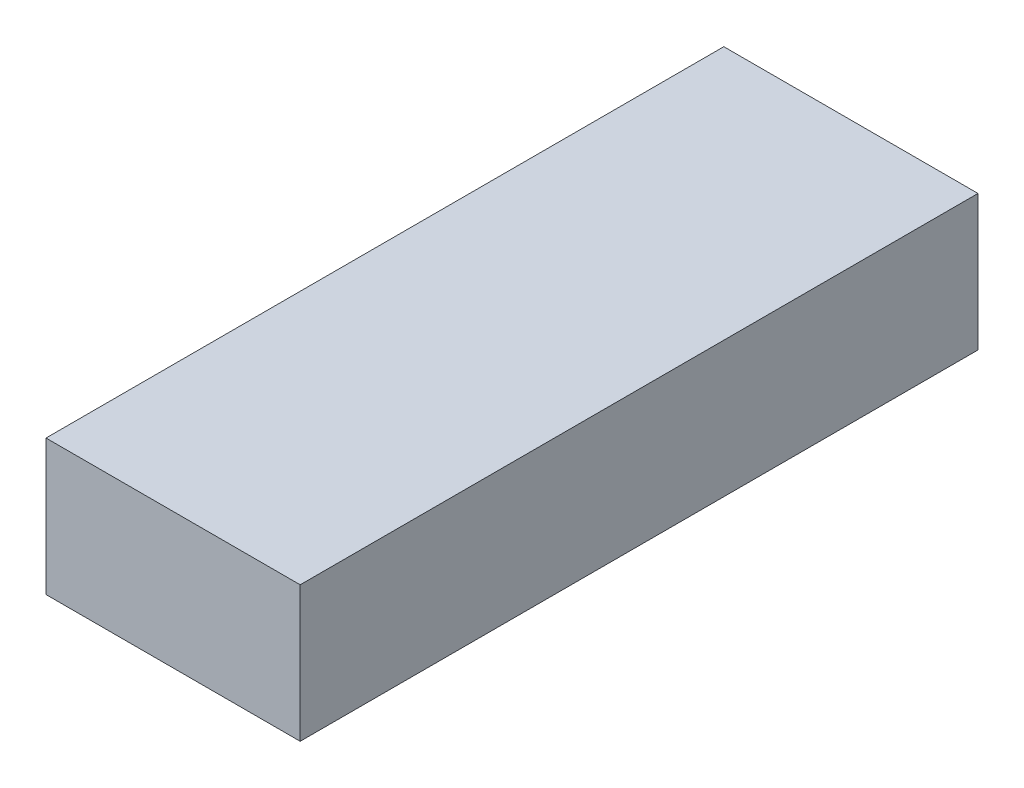
ISO-10303-21;
HEADER;
FILE_DESCRIPTION(('STEP AP214'),'2;1');
FILE_NAME('part.step','',(''),(''),'','','');
FILE_SCHEMA(('AUTOMOTIVE_DESIGN { 1 0 10303 214 1 1 1 1 }'));
ENDSEC;
DATA;
#1=APPLICATION_CONTEXT('core data for automotive mechanical design processes');
#2=APPLICATION_PROTOCOL_DEFINITION('international standard','automotive_design',2000,#1);
#3=PRODUCT_CONTEXT('',#1,'mechanical');
#4=PRODUCT('Part','Part','',(#3));
#5=PRODUCT_RELATED_PRODUCT_CATEGORY('part','',(#4));
#6=PRODUCT_DEFINITION_FORMATION('','',#4);
#7=PRODUCT_DEFINITION_CONTEXT('part definition',#1,'design');
#8=PRODUCT_DEFINITION('design','',#6,#7);
#9=PRODUCT_DEFINITION_SHAPE('','',#8);
#10=(LENGTH_UNIT() NAMED_UNIT(*) SI_UNIT(.MILLI.,.METRE.));
#11=(NAMED_UNIT(*) PLANE_ANGLE_UNIT() SI_UNIT($,.RADIAN.));
#12=(NAMED_UNIT(*) SI_UNIT($,.STERADIAN.) SOLID_ANGLE_UNIT());
#13=UNCERTAINTY_MEASURE_WITH_UNIT(LENGTH_MEASURE(1.E-05),#10,'distance_accuracy_value','');
#14=(GEOMETRIC_REPRESENTATION_CONTEXT(3) GLOBAL_UNCERTAINTY_ASSIGNED_CONTEXT((#13)) GLOBAL_UNIT_ASSIGNED_CONTEXT((#10,
#11,#12)) REPRESENTATION_CONTEXT('',''));
#15=CARTESIAN_POINT('',(0.,0.,0.));
#16=DIRECTION('',(0.,0.,1.));
#17=DIRECTION('',(1.,0.,0.));
#18=AXIS2_PLACEMENT_3D('',#15,#16,#17);
#19=CARTESIAN_POINT('',(70.,-35.,400.));
#20=DIRECTION('',(-1.,0.,0.));
#21=DIRECTION('',(0.,0.,1.));
#22=AXIS2_PLACEMENT_3D('',#19,#20,#21);
#23=PLANE('',#22);
#24=DIRECTION('',(0.,0.,-1.));
#25=VECTOR('',#24,1.);
#26=CARTESIAN_POINT('',(70.,-35.,400.));
#27=LINE('',#26,#25);
#28=CARTESIAN_POINT('',(70.,-35.,395.));
#29=VERTEX_POINT('',#28);
#30=CARTESIAN_POINT('',(70.,-35.,0.));
#31=VERTEX_POINT('',#30);
#32=EDGE_CURVE('E65',#29,#31,#27,.T.);
#33=ORIENTED_EDGE('',*,*,#32,.F.);
#34=DIRECTION('',(0.,1.,0.));
#35=VECTOR('',#34,1.);
#36=CARTESIAN_POINT('',(70.,-35.,395.));
#37=LINE('',#36,#35);
#38=CARTESIAN_POINT('',(70.,35.,395.));
#39=VERTEX_POINT('',#38);
#40=EDGE_CURVE('E59',#29,#39,#37,.T.);
#41=ORIENTED_EDGE('',*,*,#40,.T.);
#42=DIRECTION('',(0.,0.,-1.));
#43=VECTOR('',#42,1.);
#44=CARTESIAN_POINT('',(70.,35.,400.));
#45=LINE('',#44,#43);
#46=CARTESIAN_POINT('',(70.,35.,0.));
#47=VERTEX_POINT('',#46);
#48=EDGE_CURVE('E128',#39,#47,#45,.T.);
#49=ORIENTED_EDGE('',*,*,#48,.T.);
#50=DIRECTION('',(0.,1.,0.));
#51=VECTOR('',#50,1.);
#52=CARTESIAN_POINT('',(70.,-35.,0.));
#53=LINE('',#52,#51);
#54=EDGE_CURVE('E312',#31,#47,#53,.T.);
#55=ORIENTED_EDGE('',*,*,#54,.F.);
#56=EDGE_LOOP('',(#33,#41,#49,#55));
#57=FACE_BOUND('',#56,.T.);
#58=ADVANCED_FACE('F43',(#57),#23,.T.);
#59=CARTESIAN_POINT('',(-70.,35.,400.));
#60=DIRECTION('',(0.,-1.,0.));
#61=DIRECTION('',(0.,0.,-1.));
#62=AXIS2_PLACEMENT_3D('',#59,#60,#61);
#63=PLANE('',#62);
#64=ORIENTED_EDGE('',*,*,#48,.F.);
#65=DIRECTION('',(-1.,0.,0.));
#66=VECTOR('',#65,1.);
#67=CARTESIAN_POINT('',(-70.,35.,395.));
#68=LINE('',#67,#66);
#69=CARTESIAN_POINT('',(-70.,35.,395.));
#70=VERTEX_POINT('',#69);
#71=EDGE_CURVE('E118',#39,#70,#68,.T.);
#72=ORIENTED_EDGE('',*,*,#71,.T.);
#73=DIRECTION('',(0.,0.,-1.));
#74=VECTOR('',#73,1.);
#75=CARTESIAN_POINT('',(-70.,35.,400.));
#76=LINE('',#75,#74);
#77=CARTESIAN_POINT('',(-70.,35.,0.));
#78=VERTEX_POINT('',#77);
#79=EDGE_CURVE('E116',#70,#78,#76,.T.);
#80=ORIENTED_EDGE('',*,*,#79,.T.);
#81=DIRECTION('',(-1.,0.,0.));
#82=VECTOR('',#81,1.);
#83=CARTESIAN_POINT('',(-70.,35.,0.));
#84=LINE('',#83,#82);
#85=EDGE_CURVE('E316',#47,#78,#84,.T.);
#86=ORIENTED_EDGE('',*,*,#85,.F.);
#87=EDGE_LOOP('',(#64,#72,#80,#86));
#88=FACE_BOUND('',#87,.T.);
#89=ADVANCED_FACE('F208',(#88),#63,.T.);
#90=CARTESIAN_POINT('',(-70.,-35.,400.));
#91=DIRECTION('',(1.,0.,0.));
#92=DIRECTION('',(0.,0.,-1.));
#93=AXIS2_PLACEMENT_3D('',#90,#91,#92);
#94=PLANE('',#93);
#95=ORIENTED_EDGE('',*,*,#79,.F.);
#96=DIRECTION('',(0.,-1.,0.));
#97=VECTOR('',#96,1.);
#98=CARTESIAN_POINT('',(-70.,-35.,395.));
#99=LINE('',#98,#97);
#100=CARTESIAN_POINT('',(-70.,-35.,395.));
#101=VERTEX_POINT('',#100);
#102=EDGE_CURVE('E108',#70,#101,#99,.T.);
#103=ORIENTED_EDGE('',*,*,#102,.T.);
#104=DIRECTION('',(0.,0.,-1.));
#105=VECTOR('',#104,1.);
#106=CARTESIAN_POINT('',(-70.,-35.,400.));
#107=LINE('',#106,#105);
#108=CARTESIAN_POINT('',(-70.,-35.,0.));
#109=VERTEX_POINT('',#108);
#110=EDGE_CURVE('E115',#101,#109,#107,.T.);
#111=ORIENTED_EDGE('',*,*,#110,.T.);
#112=DIRECTION('',(0.,-1.,0.));
#113=VECTOR('',#112,1.);
#114=CARTESIAN_POINT('',(-70.,-35.,0.));
#115=LINE('',#114,#113);
#116=EDGE_CURVE('E318',#78,#109,#115,.T.);
#117=ORIENTED_EDGE('',*,*,#116,.F.);
#118=EDGE_LOOP('',(#95,#103,#111,#117));
#119=FACE_BOUND('',#118,.T.);
#120=ADVANCED_FACE('F113',(#119),#94,.T.);
#121=CARTESIAN_POINT('',(-70.,-35.,400.));
#122=DIRECTION('',(0.,1.,0.));
#123=DIRECTION('',(0.,0.,1.));
#124=AXIS2_PLACEMENT_3D('',#121,#122,#123);
#125=PLANE('',#124);
#126=ORIENTED_EDGE('',*,*,#110,.F.);
#127=DIRECTION('',(1.,0.,0.));
#128=VECTOR('',#127,1.);
#129=CARTESIAN_POINT('',(-70.,-35.,395.));
#130=LINE('',#129,#128);
#131=EDGE_CURVE('E11',#101,#29,#130,.T.);
#132=ORIENTED_EDGE('',*,*,#131,.T.);
#133=ORIENTED_EDGE('',*,*,#32,.T.);
#134=DIRECTION('',(1.,0.,0.));
#135=VECTOR('',#134,1.);
#136=CARTESIAN_POINT('',(-70.,-35.,0.));
#137=LINE('',#136,#135);
#138=EDGE_CURVE('E122',#109,#31,#137,.T.);
#139=ORIENTED_EDGE('',*,*,#138,.F.);
#140=EDGE_LOOP('',(#126,#132,#133,#139));
#141=FACE_BOUND('',#140,.T.);
#142=ADVANCED_FACE('F120',(#141),#125,.T.);
#143=CARTESIAN_POINT('',(0.,0.,400.));
#144=DIRECTION('',(0.,0.,-1.));
#145=DIRECTION('',(-1.,0.,0.));
#146=AXIS2_PLACEMENT_3D('',#143,#144,#145);
#147=PLANE('',#146);
#148=DIRECTION('',(0.,1.,0.));
#149=VECTOR('',#148,1.);
#150=CARTESIAN_POINT('',(75.,-40.,400.));
#151=LINE('',#150,#149);
#152=CARTESIAN_POINT('',(75.,-40.,400.));
#153=VERTEX_POINT('',#152);
#154=CARTESIAN_POINT('',(75.,40.,400.));
#155=VERTEX_POINT('',#154);
#156=EDGE_CURVE('E136',#153,#155,#151,.T.);
#157=ORIENTED_EDGE('',*,*,#156,.T.);
#158=DIRECTION('',(-1.,0.,0.));
#159=VECTOR('',#158,1.);
#160=CARTESIAN_POINT('',(-75.,40.,400.));
#161=LINE('',#160,#159);
#162=CARTESIAN_POINT('',(-75.,40.,400.));
#163=VERTEX_POINT('',#162);
#164=EDGE_CURVE('E140',#155,#163,#161,.T.);
#165=ORIENTED_EDGE('',*,*,#164,.T.);
#166=DIRECTION('',(0.,-1.,0.));
#167=VECTOR('',#166,1.);
#168=CARTESIAN_POINT('',(-75.,-40.,400.));
#169=LINE('',#168,#167);
#170=CARTESIAN_POINT('',(-75.,-40.,400.));
#171=VERTEX_POINT('',#170);
#172=EDGE_CURVE('E144',#163,#171,#169,.T.);
#173=ORIENTED_EDGE('',*,*,#172,.T.);
#174=DIRECTION('',(1.,0.,0.));
#175=VECTOR('',#174,1.);
#176=CARTESIAN_POINT('',(-75.,-40.,400.));
#177=LINE('',#176,#175);
#178=EDGE_CURVE('E147',#171,#153,#177,.T.);
#179=ORIENTED_EDGE('',*,*,#178,.T.);
#180=EDGE_LOOP('',(#157,#165,#173,#179));
#181=FACE_BOUND('',#180,.T.);
#182=ADVANCED_FACE('F195',(#181),#147,.F.);
#183=CARTESIAN_POINT('',(0.,0.,0.));
#184=DIRECTION('',(0.,0.,-1.));
#185=DIRECTION('',(-1.,0.,0.));
#186=AXIS2_PLACEMENT_3D('',#183,#184,#185);
#187=PLANE('',#186);
#188=DIRECTION('',(0.,1.,0.));
#189=VECTOR('',#188,1.);
#190=CARTESIAN_POINT('',(75.,-40.,0.));
#191=LINE('',#190,#189);
#192=CARTESIAN_POINT('',(75.,-40.,0.));
#193=VERTEX_POINT('',#192);
#194=CARTESIAN_POINT('',(75.,40.,0.));
#195=VERTEX_POINT('',#194);
#196=EDGE_CURVE('E135',#193,#195,#191,.T.);
#197=ORIENTED_EDGE('',*,*,#196,.F.);
#198=DIRECTION('',(1.,0.,0.));
#199=VECTOR('',#198,1.);
#200=CARTESIAN_POINT('',(-75.,-40.,0.));
#201=LINE('',#200,#199);
#202=CARTESIAN_POINT('',(-75.,-40.,0.));
#203=VERTEX_POINT('',#202);
#204=EDGE_CURVE('E141',#203,#193,#201,.T.);
#205=ORIENTED_EDGE('',*,*,#204,.F.);
#206=DIRECTION('',(0.,-1.,0.));
#207=VECTOR('',#206,1.);
#208=CARTESIAN_POINT('',(-75.,-40.,0.));
#209=LINE('',#208,#207);
#210=CARTESIAN_POINT('',(-75.,40.,0.));
#211=VERTEX_POINT('',#210);
#212=EDGE_CURVE('E158',#211,#203,#209,.T.);
#213=ORIENTED_EDGE('',*,*,#212,.F.);
#214=DIRECTION('',(-1.,0.,0.));
#215=VECTOR('',#214,1.);
#216=CARTESIAN_POINT('',(-75.,40.,0.));
#217=LINE('',#216,#215);
#218=EDGE_CURVE('E154',#195,#211,#217,.T.);
#219=ORIENTED_EDGE('',*,*,#218,.F.);
#220=EDGE_LOOP('',(#197,#205,#213,#219));
#221=FACE_BOUND('',#220,.T.);
#222=ORIENTED_EDGE('',*,*,#138,.T.);
#223=ORIENTED_EDGE('',*,*,#54,.T.);
#224=ORIENTED_EDGE('',*,*,#85,.T.);
#225=ORIENTED_EDGE('',*,*,#116,.T.);
#226=EDGE_LOOP('',(#222,#223,#224,#225));
#227=FACE_BOUND('',#226,.T.);
#228=ADVANCED_FACE('F183',(#221,#227),#187,.T.);
#229=CARTESIAN_POINT('',(75.,-40.,400.));
#230=DIRECTION('',(-1.,0.,0.));
#231=DIRECTION('',(0.,0.,1.));
#232=AXIS2_PLACEMENT_3D('',#229,#230,#231);
#233=PLANE('',#232);
#234=DIRECTION('',(0.,0.,-1.));
#235=VECTOR('',#234,1.);
#236=CARTESIAN_POINT('',(75.,-40.,400.));
#237=LINE('',#236,#235);
#238=EDGE_CURVE('E150',#153,#193,#237,.T.);
#239=ORIENTED_EDGE('',*,*,#238,.T.);
#240=ORIENTED_EDGE('',*,*,#196,.T.);
#241=DIRECTION('',(0.,0.,-1.));
#242=VECTOR('',#241,1.);
#243=CARTESIAN_POINT('',(75.,40.,400.));
#244=LINE('',#243,#242);
#245=EDGE_CURVE('E52',#155,#195,#244,.T.);
#246=ORIENTED_EDGE('',*,*,#245,.F.);
#247=ORIENTED_EDGE('',*,*,#156,.F.);
#248=EDGE_LOOP('',(#239,#240,#246,#247));
#249=FACE_BOUND('',#248,.T.);
#250=ADVANCED_FACE('F45',(#249),#233,.F.);
#251=CARTESIAN_POINT('',(-75.,40.,400.));
#252=DIRECTION('',(0.,-1.,0.));
#253=DIRECTION('',(0.,0.,-1.));
#254=AXIS2_PLACEMENT_3D('',#251,#252,#253);
#255=PLANE('',#254);
#256=ORIENTED_EDGE('',*,*,#245,.T.);
#257=ORIENTED_EDGE('',*,*,#218,.T.);
#258=DIRECTION('',(0.,0.,-1.));
#259=VECTOR('',#258,1.);
#260=CARTESIAN_POINT('',(-75.,40.,400.));
#261=LINE('',#260,#259);
#262=EDGE_CURVE('E170',#163,#211,#261,.T.);
#263=ORIENTED_EDGE('',*,*,#262,.F.);
#264=ORIENTED_EDGE('',*,*,#164,.F.);
#265=EDGE_LOOP('',(#256,#257,#263,#264));
#266=FACE_BOUND('',#265,.T.);
#267=ADVANCED_FACE('F176',(#266),#255,.F.);
#268=CARTESIAN_POINT('',(-75.,-40.,400.));
#269=DIRECTION('',(1.,0.,0.));
#270=DIRECTION('',(0.,0.,-1.));
#271=AXIS2_PLACEMENT_3D('',#268,#269,#270);
#272=PLANE('',#271);
#273=ORIENTED_EDGE('',*,*,#262,.T.);
#274=ORIENTED_EDGE('',*,*,#212,.T.);
#275=DIRECTION('',(0.,0.,-1.));
#276=VECTOR('',#275,1.);
#277=CARTESIAN_POINT('',(-75.,-40.,400.));
#278=LINE('',#277,#276);
#279=EDGE_CURVE('E167',#171,#203,#278,.T.);
#280=ORIENTED_EDGE('',*,*,#279,.F.);
#281=ORIENTED_EDGE('',*,*,#172,.F.);
#282=EDGE_LOOP('',(#273,#274,#280,#281));
#283=FACE_BOUND('',#282,.T.);
#284=ADVANCED_FACE('F193',(#283),#272,.F.);
#285=CARTESIAN_POINT('',(-75.,-40.,400.));
#286=DIRECTION('',(0.,1.,0.));
#287=DIRECTION('',(0.,0.,1.));
#288=AXIS2_PLACEMENT_3D('',#285,#286,#287);
#289=PLANE('',#288);
#290=ORIENTED_EDGE('',*,*,#279,.T.);
#291=ORIENTED_EDGE('',*,*,#204,.T.);
#292=ORIENTED_EDGE('',*,*,#238,.F.);
#293=ORIENTED_EDGE('',*,*,#178,.F.);
#294=EDGE_LOOP('',(#290,#291,#292,#293));
#295=FACE_BOUND('',#294,.T.);
#296=ADVANCED_FACE('F189',(#295),#289,.F.);
#297=CARTESIAN_POINT('',(0.,0.,395.));
#298=DIRECTION('',(0.,0.,1.));
#299=DIRECTION('',(1.,0.,0.));
#300=AXIS2_PLACEMENT_3D('',#297,#298,#299);
#301=PLANE('',#300);
#302=ORIENTED_EDGE('',*,*,#40,.F.);
#303=ORIENTED_EDGE('',*,*,#131,.F.);
#304=ORIENTED_EDGE('',*,*,#102,.F.);
#305=ORIENTED_EDGE('',*,*,#71,.F.);
#306=EDGE_LOOP('',(#302,#303,#304,#305));
#307=FACE_BOUND('',#306,.T.);
#308=ADVANCED_FACE('F107',(#307),#301,.F.);
#309=CLOSED_SHELL('',(#58,#89,#120,#142,#182,#228,#250,#267,#284,#296,#308));
#310=MANIFOLD_SOLID_BREP('B2',#309);
#311=ADVANCED_BREP_SHAPE_REPRESENTATION('',(#18,#310),#14);
#312=SHAPE_DEFINITION_REPRESENTATION(#9,#311);
ENDSEC;
END-ISO-10303-21;
